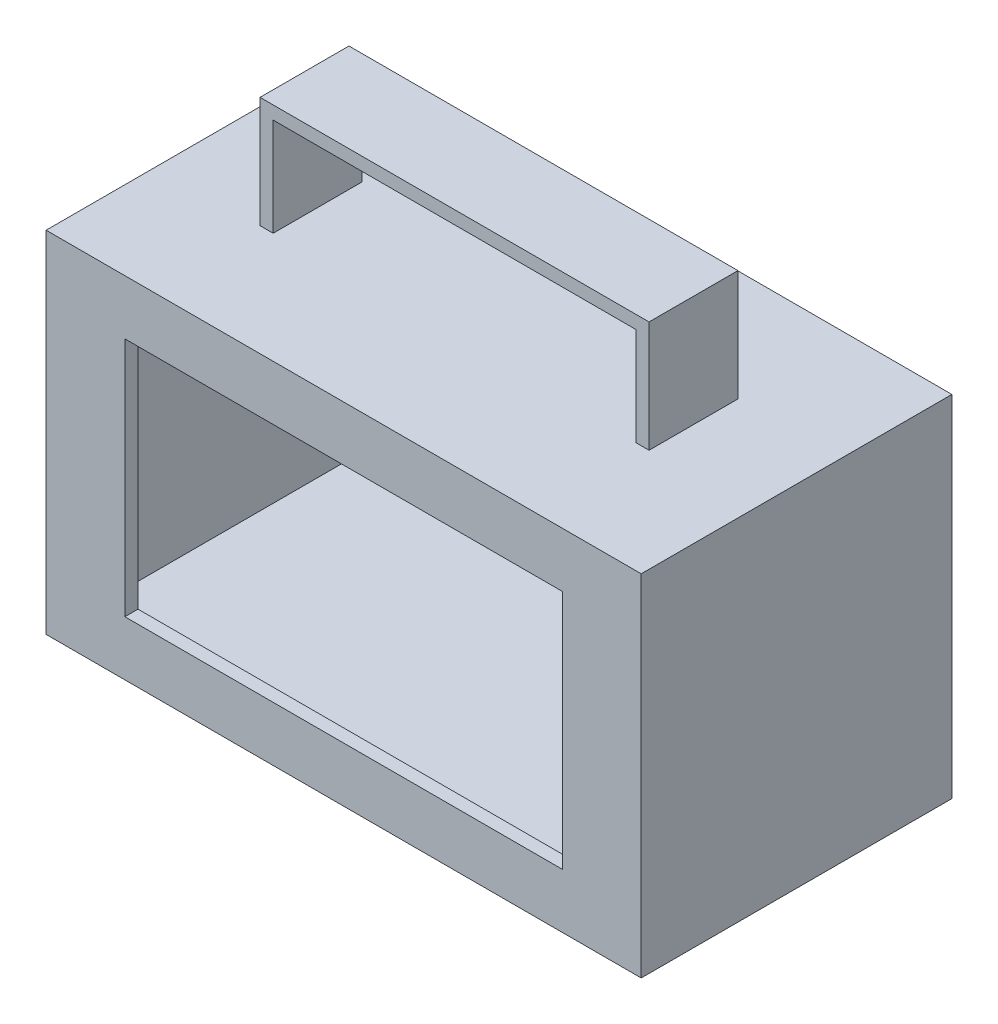
ISO-10303-21;
HEADER;
FILE_DESCRIPTION(('STEP AP214'),'2;1');
FILE_NAME('part.step','',(''),(''),'','','');
FILE_SCHEMA(('AUTOMOTIVE_DESIGN { 1 0 10303 214 1 1 1 1 }'));
ENDSEC;
DATA;
#1=APPLICATION_CONTEXT('core data for automotive mechanical design processes');
#2=APPLICATION_PROTOCOL_DEFINITION('international standard','automotive_design',2000,#1);
#3=PRODUCT_CONTEXT('',#1,'mechanical');
#4=PRODUCT('Part','Part','',(#3));
#5=PRODUCT_RELATED_PRODUCT_CATEGORY('part','',(#4));
#6=PRODUCT_DEFINITION_FORMATION('','',#4);
#7=PRODUCT_DEFINITION_CONTEXT('part definition',#1,'design');
#8=PRODUCT_DEFINITION('design','',#6,#7);
#9=PRODUCT_DEFINITION_SHAPE('','',#8);
#10=(LENGTH_UNIT() NAMED_UNIT(*) SI_UNIT(.MILLI.,.METRE.));
#11=(NAMED_UNIT(*) PLANE_ANGLE_UNIT() SI_UNIT($,.RADIAN.));
#12=(NAMED_UNIT(*) SI_UNIT($,.STERADIAN.) SOLID_ANGLE_UNIT());
#13=UNCERTAINTY_MEASURE_WITH_UNIT(LENGTH_MEASURE(1.E-05),#10,'distance_accuracy_value','');
#14=(GEOMETRIC_REPRESENTATION_CONTEXT(3) GLOBAL_UNCERTAINTY_ASSIGNED_CONTEXT((#13)) GLOBAL_UNIT_ASSIGNED_CONTEXT((#10,
#11,#12)) REPRESENTATION_CONTEXT('',''));
#15=CARTESIAN_POINT('',(0.,0.,0.));
#16=DIRECTION('',(0.,0.,1.));
#17=DIRECTION('',(1.,0.,0.));
#18=AXIS2_PLACEMENT_3D('',#15,#16,#17);
#19=CARTESIAN_POINT('',(-65.,207.034610777285,32.5));
#20=DIRECTION('',(0.,0.,1.));
#21=DIRECTION('',(1.,0.,0.));
#22=AXIS2_PLACEMENT_3D('',#19,#20,#21);
#23=PLANE('',#22);
#24=DIRECTION('',(1.,0.,0.));
#25=VECTOR('',#24,1.);
#26=CARTESIAN_POINT('',(-65.,12.5,32.5));
#27=LINE('',#26,#25);
#28=CARTESIAN_POINT('',(-50.,12.5,32.5));
#29=VERTEX_POINT('',#28);
#30=CARTESIAN_POINT('',(50.,12.5,32.5));
#31=VERTEX_POINT('',#30);
#32=EDGE_CURVE('E44',#29,#31,#27,.T.);
#33=ORIENTED_EDGE('',*,*,#32,.T.);
#34=DIRECTION('',(0.,1.,0.));
#35=VECTOR('',#34,1.);
#36=CARTESIAN_POINT('',(50.,207.034610777285,32.5));
#37=LINE('',#36,#35);
#38=CARTESIAN_POINT('',(50.,67.5,32.5));
#39=VERTEX_POINT('',#38);
#40=EDGE_CURVE('E11',#31,#39,#37,.T.);
#41=ORIENTED_EDGE('',*,*,#40,.T.);
#42=DIRECTION('',(-1.,0.,0.));
#43=VECTOR('',#42,1.);
#44=CARTESIAN_POINT('',(-65.,67.5,32.5));
#45=LINE('',#44,#43);
#46=CARTESIAN_POINT('',(-50.,67.5,32.5));
#47=VERTEX_POINT('',#46);
#48=EDGE_CURVE('E372',#39,#47,#45,.T.);
#49=ORIENTED_EDGE('',*,*,#48,.T.);
#50=DIRECTION('',(0.,-1.,0.));
#51=VECTOR('',#50,1.);
#52=CARTESIAN_POINT('',(-50.,207.034610777285,32.5));
#53=LINE('',#52,#51);
#54=EDGE_CURVE('E375',#47,#29,#53,.T.);
#55=ORIENTED_EDGE('',*,*,#54,.T.);
#56=EDGE_LOOP('',(#33,#41,#49,#55));
#57=FACE_BOUND('',#56,.T.);
#58=DIRECTION('',(0.,-1.,0.));
#59=VECTOR('',#58,1.);
#60=CARTESIAN_POINT('',(-65.,207.034610777285,32.5));
#61=LINE('',#60,#59);
#62=CARTESIAN_POINT('',(-65.,77.,32.5));
#63=VERTEX_POINT('',#62);
#64=CARTESIAN_POINT('',(-65.,3.,32.5));
#65=VERTEX_POINT('',#64);
#66=EDGE_CURVE('E312',#63,#65,#61,.T.);
#67=ORIENTED_EDGE('',*,*,#66,.F.);
#68=DIRECTION('',(1.,0.,0.));
#69=VECTOR('',#68,1.);
#70=CARTESIAN_POINT('',(-65.,77.,32.5));
#71=LINE('',#70,#69);
#72=CARTESIAN_POINT('',(65.,77.,32.5));
#73=VERTEX_POINT('',#72);
#74=EDGE_CURVE('E318',#63,#73,#71,.T.);
#75=ORIENTED_EDGE('',*,*,#74,.T.);
#76=DIRECTION('',(0.,-1.,0.));
#77=VECTOR('',#76,1.);
#78=CARTESIAN_POINT('',(65.,207.034610777285,32.5));
#79=LINE('',#78,#77);
#80=CARTESIAN_POINT('',(65.,3.,32.5));
#81=VERTEX_POINT('',#80);
#82=EDGE_CURVE('E315',#73,#81,#79,.T.);
#83=ORIENTED_EDGE('',*,*,#82,.T.);
#84=DIRECTION('',(-1.,0.,0.));
#85=VECTOR('',#84,1.);
#86=CARTESIAN_POINT('',(-65.,3.,32.5));
#87=LINE('',#86,#85);
#88=EDGE_CURVE('E309',#81,#65,#87,.T.);
#89=ORIENTED_EDGE('',*,*,#88,.T.);
#90=EDGE_LOOP('',(#67,#75,#83,#89));
#91=FACE_BOUND('',#90,.T.);
#92=ADVANCED_FACE('F36',(#57,#91),#23,.F.);
#93=CARTESIAN_POINT('',(-68.,80.,-32.5));
#94=DIRECTION('',(0.,0.,1.));
#95=DIRECTION('',(1.,0.,0.));
#96=AXIS2_PLACEMENT_3D('',#93,#94,#95);
#97=PLANE('',#96);
#98=DIRECTION('',(0.,1.,0.));
#99=VECTOR('',#98,1.);
#100=CARTESIAN_POINT('',(56.3249908040904,80.,-32.5));
#101=LINE('',#100,#99);
#102=CARTESIAN_POINT('',(56.3249908040903,21.2299770061563,-32.5));
#103=VERTEX_POINT('',#102);
#104=CARTESIAN_POINT('',(56.3249908040903,61.2299770061563,-32.5));
#105=VERTEX_POINT('',#104);
#106=EDGE_CURVE('E229',#103,#105,#101,.T.);
#107=ORIENTED_EDGE('',*,*,#106,.F.);
#108=DIRECTION('',(1.,0.,0.));
#109=VECTOR('',#108,1.);
#110=CARTESIAN_POINT('',(-68.,21.2299770061563,-32.5));
#111=LINE('',#110,#109);
#112=CARTESIAN_POINT('',(-53.6750091959097,21.2299770061563,-32.5));
#113=VERTEX_POINT('',#112);
#114=EDGE_CURVE('E222',#113,#103,#111,.T.);
#115=ORIENTED_EDGE('',*,*,#114,.F.);
#116=DIRECTION('',(0.,-1.,0.));
#117=VECTOR('',#116,1.);
#118=CARTESIAN_POINT('',(-53.6750091959096,80.,-32.5));
#119=LINE('',#118,#117);
#120=CARTESIAN_POINT('',(-53.6750091959097,61.2299770061563,-32.5));
#121=VERTEX_POINT('',#120);
#122=EDGE_CURVE('E203',#121,#113,#119,.T.);
#123=ORIENTED_EDGE('',*,*,#122,.F.);
#124=DIRECTION('',(-1.,0.,0.));
#125=VECTOR('',#124,1.);
#126=CARTESIAN_POINT('',(-68.,61.2299770061563,-32.5));
#127=LINE('',#126,#125);
#128=EDGE_CURVE('E227',#105,#121,#127,.T.);
#129=ORIENTED_EDGE('',*,*,#128,.F.);
#130=EDGE_LOOP('',(#107,#115,#123,#129));
#131=FACE_BOUND('',#130,.T.);
#132=DIRECTION('',(-1.,0.,0.));
#133=VECTOR('',#132,1.);
#134=CARTESIAN_POINT('',(0.,3.,-32.5));
#135=LINE('',#134,#133);
#136=CARTESIAN_POINT('',(65.,3.,-32.5));
#137=VERTEX_POINT('',#136);
#138=CARTESIAN_POINT('',(-65.,3.,-32.5));
#139=VERTEX_POINT('',#138);
#140=EDGE_CURVE('E321',#137,#139,#135,.T.);
#141=ORIENTED_EDGE('',*,*,#140,.F.);
#142=DIRECTION('',(0.,-1.,0.));
#143=VECTOR('',#142,1.);
#144=CARTESIAN_POINT('',(65.,80.,-32.5));
#145=LINE('',#144,#143);
#146=CARTESIAN_POINT('',(65.,77.,-32.5));
#147=VERTEX_POINT('',#146);
#148=EDGE_CURVE('E329',#147,#137,#145,.T.);
#149=ORIENTED_EDGE('',*,*,#148,.F.);
#150=DIRECTION('',(-1.,0.,0.));
#151=VECTOR('',#150,1.);
#152=CARTESIAN_POINT('',(0.,77.,-32.5));
#153=LINE('',#152,#151);
#154=CARTESIAN_POINT('',(-65.,77.,-32.5));
#155=VERTEX_POINT('',#154);
#156=EDGE_CURVE('E330',#147,#155,#153,.T.);
#157=ORIENTED_EDGE('',*,*,#156,.T.);
#158=DIRECTION('',(0.,-1.,0.));
#159=VECTOR('',#158,1.);
#160=CARTESIAN_POINT('',(-65.,80.,-32.5));
#161=LINE('',#160,#159);
#162=EDGE_CURVE('E325',#155,#139,#161,.T.);
#163=ORIENTED_EDGE('',*,*,#162,.T.);
#164=EDGE_LOOP('',(#141,#149,#157,#163));
#165=FACE_BOUND('',#164,.T.);
#166=ADVANCED_FACE('F411',(#131,#165),#97,.T.);
#167=CARTESIAN_POINT('',(0.,77.,0.));
#168=DIRECTION('',(0.,-1.,0.));
#169=DIRECTION('',(0.,0.,-1.));
#170=AXIS2_PLACEMENT_3D('',#167,#168,#169);
#171=PLANE('',#170);
#172=DIRECTION('',(0.,0.,-1.));
#173=VECTOR('',#172,1.);
#174=CARTESIAN_POINT('',(65.,77.,0.));
#175=LINE('',#174,#173);
#176=EDGE_CURVE('E337',#73,#147,#175,.T.);
#177=ORIENTED_EDGE('',*,*,#176,.F.);
#178=ORIENTED_EDGE('',*,*,#74,.F.);
#179=DIRECTION('',(0.,0.,1.));
#180=VECTOR('',#179,1.);
#181=CARTESIAN_POINT('',(-65.,77.,0.));
#182=LINE('',#181,#180);
#183=EDGE_CURVE('E333',#155,#63,#182,.T.);
#184=ORIENTED_EDGE('',*,*,#183,.F.);
#185=ORIENTED_EDGE('',*,*,#156,.F.);
#186=EDGE_LOOP('',(#177,#178,#184,#185));
#187=FACE_BOUND('',#186,.T.);
#188=ADVANCED_FACE('F416',(#187),#171,.T.);
#189=CARTESIAN_POINT('',(0.,3.,0.));
#190=DIRECTION('',(0.,-1.,0.));
#191=DIRECTION('',(0.,0.,-1.));
#192=AXIS2_PLACEMENT_3D('',#189,#190,#191);
#193=PLANE('',#192);
#194=ORIENTED_EDGE('',*,*,#88,.F.);
#195=DIRECTION('',(0.,0.,-1.));
#196=VECTOR('',#195,1.);
#197=CARTESIAN_POINT('',(65.,3.,0.));
#198=LINE('',#197,#196);
#199=EDGE_CURVE('E334',#81,#137,#198,.T.);
#200=ORIENTED_EDGE('',*,*,#199,.T.);
#201=ORIENTED_EDGE('',*,*,#140,.T.);
#202=DIRECTION('',(0.,0.,1.));
#203=VECTOR('',#202,1.);
#204=CARTESIAN_POINT('',(-65.,3.,0.));
#205=LINE('',#204,#203);
#206=EDGE_CURVE('E324',#139,#65,#205,.T.);
#207=ORIENTED_EDGE('',*,*,#206,.T.);
#208=EDGE_LOOP('',(#194,#200,#201,#207));
#209=FACE_BOUND('',#208,.T.);
#210=ADVANCED_FACE('F430',(#209),#193,.F.);
#211=CARTESIAN_POINT('',(65.,80.,-35.5));
#212=DIRECTION('',(-1.,0.,0.));
#213=DIRECTION('',(0.,0.,1.));
#214=AXIS2_PLACEMENT_3D('',#211,#212,#213);
#215=PLANE('',#214);
#216=ORIENTED_EDGE('',*,*,#199,.F.);
#217=ORIENTED_EDGE('',*,*,#82,.F.);
#218=ORIENTED_EDGE('',*,*,#176,.T.);
#219=ORIENTED_EDGE('',*,*,#148,.T.);
#220=EDGE_LOOP('',(#216,#217,#218,#219));
#221=FACE_BOUND('',#220,.T.);
#222=ADVANCED_FACE('F426',(#221),#215,.T.);
#223=CARTESIAN_POINT('',(-65.,80.,-35.5));
#224=DIRECTION('',(1.,0.,0.));
#225=DIRECTION('',(0.,0.,-1.));
#226=AXIS2_PLACEMENT_3D('',#223,#224,#225);
#227=PLANE('',#226);
#228=ORIENTED_EDGE('',*,*,#183,.T.);
#229=ORIENTED_EDGE('',*,*,#66,.T.);
#230=ORIENTED_EDGE('',*,*,#206,.F.);
#231=ORIENTED_EDGE('',*,*,#162,.F.);
#232=EDGE_LOOP('',(#228,#229,#230,#231));
#233=FACE_BOUND('',#232,.T.);
#234=ADVANCED_FACE('F423',(#233),#227,.T.);
#235=CARTESIAN_POINT('',(50.,67.5,25.5));
#236=DIRECTION('',(1.,0.,0.));
#237=DIRECTION('',(0.,1.,0.));
#238=AXIS2_PLACEMENT_3D('',#235,#236,#237);
#239=PLANE('',#238);
#240=DIRECTION('',(0.,0.,1.));
#241=VECTOR('',#240,1.);
#242=CARTESIAN_POINT('',(50.,12.5,25.5));
#243=LINE('',#242,#241);
#244=CARTESIAN_POINT('',(50.,12.5,35.5));
#245=VERTEX_POINT('',#244);
#246=EDGE_CURVE('E243',#31,#245,#243,.T.);
#247=ORIENTED_EDGE('',*,*,#246,.T.);
#248=DIRECTION('',(0.,1.,0.));
#249=VECTOR('',#248,1.);
#250=CARTESIAN_POINT('',(50.,67.5,35.5));
#251=LINE('',#250,#249);
#252=CARTESIAN_POINT('',(50.,67.5,35.5));
#253=VERTEX_POINT('',#252);
#254=EDGE_CURVE('E231',#245,#253,#251,.T.);
#255=ORIENTED_EDGE('',*,*,#254,.T.);
#256=DIRECTION('',(0.,0.,1.));
#257=VECTOR('',#256,1.);
#258=CARTESIAN_POINT('',(50.,67.5,25.5));
#259=LINE('',#258,#257);
#260=EDGE_CURVE('E242',#39,#253,#259,.T.);
#261=ORIENTED_EDGE('',*,*,#260,.F.);
#262=ORIENTED_EDGE('',*,*,#40,.F.);
#263=EDGE_LOOP('',(#247,#255,#261,#262));
#264=FACE_BOUND('',#263,.T.);
#265=ADVANCED_FACE('F396',(#264),#239,.F.);
#266=CARTESIAN_POINT('',(-50.,12.5,25.5));
#267=DIRECTION('',(0.,-1.,0.));
#268=DIRECTION('',(0.,0.,-1.));
#269=AXIS2_PLACEMENT_3D('',#266,#267,#268);
#270=PLANE('',#269);
#271=DIRECTION('',(0.,0.,1.));
#272=VECTOR('',#271,1.);
#273=CARTESIAN_POINT('',(-50.,12.5,25.5));
#274=LINE('',#273,#272);
#275=CARTESIAN_POINT('',(-50.,12.5,35.5));
#276=VERTEX_POINT('',#275);
#277=EDGE_CURVE('E246',#29,#276,#274,.T.);
#278=ORIENTED_EDGE('',*,*,#277,.T.);
#279=DIRECTION('',(1.,0.,0.));
#280=VECTOR('',#279,1.);
#281=CARTESIAN_POINT('',(-50.,12.5,35.5));
#282=LINE('',#281,#280);
#283=EDGE_CURVE('E239',#276,#245,#282,.T.);
#284=ORIENTED_EDGE('',*,*,#283,.T.);
#285=ORIENTED_EDGE('',*,*,#246,.F.);
#286=ORIENTED_EDGE('',*,*,#32,.F.);
#287=EDGE_LOOP('',(#278,#284,#285,#286));
#288=FACE_BOUND('',#287,.T.);
#289=ADVANCED_FACE('F384',(#288),#270,.F.);
#290=CARTESIAN_POINT('',(-50.,67.5,25.5));
#291=DIRECTION('',(-1.,0.,0.));
#292=DIRECTION('',(0.,-1.,0.));
#293=AXIS2_PLACEMENT_3D('',#290,#291,#292);
#294=PLANE('',#293);
#295=DIRECTION('',(0.,0.,1.));
#296=VECTOR('',#295,1.);
#297=CARTESIAN_POINT('',(-50.,67.5,25.5));
#298=LINE('',#297,#296);
#299=CARTESIAN_POINT('',(-50.,67.5,35.5));
#300=VERTEX_POINT('',#299);
#301=EDGE_CURVE('E248',#47,#300,#298,.T.);
#302=ORIENTED_EDGE('',*,*,#301,.T.);
#303=DIRECTION('',(0.,-1.,0.));
#304=VECTOR('',#303,1.);
#305=CARTESIAN_POINT('',(-50.,67.5,35.5));
#306=LINE('',#305,#304);
#307=EDGE_CURVE('E236',#300,#276,#306,.T.);
#308=ORIENTED_EDGE('',*,*,#307,.T.);
#309=ORIENTED_EDGE('',*,*,#277,.F.);
#310=ORIENTED_EDGE('',*,*,#54,.F.);
#311=EDGE_LOOP('',(#302,#308,#309,#310));
#312=FACE_BOUND('',#311,.T.);
#313=ADVANCED_FACE('F386',(#312),#294,.F.);
#314=CARTESIAN_POINT('',(-50.,67.5,25.5));
#315=DIRECTION('',(0.,1.,0.));
#316=DIRECTION('',(0.,0.,1.));
#317=AXIS2_PLACEMENT_3D('',#314,#315,#316);
#318=PLANE('',#317);
#319=ORIENTED_EDGE('',*,*,#260,.T.);
#320=DIRECTION('',(-1.,0.,0.));
#321=VECTOR('',#320,1.);
#322=CARTESIAN_POINT('',(-50.,67.5,35.5));
#323=LINE('',#322,#321);
#324=EDGE_CURVE('E233',#253,#300,#323,.T.);
#325=ORIENTED_EDGE('',*,*,#324,.T.);
#326=ORIENTED_EDGE('',*,*,#301,.F.);
#327=ORIENTED_EDGE('',*,*,#48,.F.);
#328=EDGE_LOOP('',(#319,#325,#326,#327));
#329=FACE_BOUND('',#328,.T.);
#330=ADVANCED_FACE('F398',(#329),#318,.F.);
#331=CARTESIAN_POINT('',(0.,80.,0.));
#332=DIRECTION('',(0.,-1.,0.));
#333=DIRECTION('',(0.,0.,-1.));
#334=AXIS2_PLACEMENT_3D('',#331,#332,#333);
#335=PLANE('',#334);
#336=DIRECTION('',(1.,0.,0.));
#337=VECTOR('',#336,1.);
#338=CARTESIAN_POINT('',(41.45,80.,10.16));
#339=LINE('',#338,#337);
#340=CARTESIAN_POINT('',(41.45,80.,10.16));
#341=VERTEX_POINT('',#340);
#342=CARTESIAN_POINT('',(44.45,80.,10.16));
#343=VERTEX_POINT('',#342);
#344=EDGE_CURVE('E262',#341,#343,#339,.T.);
#345=ORIENTED_EDGE('',*,*,#344,.F.);
#346=DIRECTION('',(0.,0.,-1.));
#347=VECTOR('',#346,1.);
#348=CARTESIAN_POINT('',(41.45,80.,10.16));
#349=LINE('',#348,#347);
#350=CARTESIAN_POINT('',(41.45,80.,-10.16));
#351=VERTEX_POINT('',#350);
#352=EDGE_CURVE('E298',#341,#351,#349,.T.);
#353=ORIENTED_EDGE('',*,*,#352,.T.);
#354=DIRECTION('',(1.,0.,0.));
#355=VECTOR('',#354,1.);
#356=CARTESIAN_POINT('',(41.45,80.,-10.16));
#357=LINE('',#356,#355);
#358=CARTESIAN_POINT('',(44.45,80.,-10.16));
#359=VERTEX_POINT('',#358);
#360=EDGE_CURVE('E279',#351,#359,#357,.T.);
#361=ORIENTED_EDGE('',*,*,#360,.T.);
#362=DIRECTION('',(0.,0.,-1.));
#363=VECTOR('',#362,1.);
#364=CARTESIAN_POINT('',(44.45,80.,10.16));
#365=LINE('',#364,#363);
#366=EDGE_CURVE('E295',#343,#359,#365,.T.);
#367=ORIENTED_EDGE('',*,*,#366,.F.);
#368=EDGE_LOOP('',(#345,#353,#361,#367));
#369=FACE_BOUND('',#368,.T.);
#370=DIRECTION('',(-1.,0.,0.));
#371=VECTOR('',#370,1.);
#372=CARTESIAN_POINT('',(-68.,80.,-35.5));
#373=LINE('',#372,#371);
#374=CARTESIAN_POINT('',(68.,80.,-35.5));
#375=VERTEX_POINT('',#374);
#376=CARTESIAN_POINT('',(-68.,80.,-35.5));
#377=VERTEX_POINT('',#376);
#378=EDGE_CURVE('E343',#375,#377,#373,.T.);
#379=ORIENTED_EDGE('',*,*,#378,.T.);
#380=DIRECTION('',(0.,0.,1.));
#381=VECTOR('',#380,1.);
#382=CARTESIAN_POINT('',(-68.,80.,-35.5));
#383=LINE('',#382,#381);
#384=CARTESIAN_POINT('',(-68.,80.,35.5));
#385=VERTEX_POINT('',#384);
#386=EDGE_CURVE('E346',#377,#385,#383,.T.);
#387=ORIENTED_EDGE('',*,*,#386,.T.);
#388=DIRECTION('',(1.,0.,0.));
#389=VECTOR('',#388,1.);
#390=CARTESIAN_POINT('',(-68.,80.,35.5));
#391=LINE('',#390,#389);
#392=CARTESIAN_POINT('',(68.,80.,35.5));
#393=VERTEX_POINT('',#392);
#394=EDGE_CURVE('E349',#385,#393,#391,.T.);
#395=ORIENTED_EDGE('',*,*,#394,.T.);
#396=DIRECTION('',(0.,0.,-1.));
#397=VECTOR('',#396,1.);
#398=CARTESIAN_POINT('',(68.,80.,-35.5));
#399=LINE('',#398,#397);
#400=EDGE_CURVE('E351',#393,#375,#399,.T.);
#401=ORIENTED_EDGE('',*,*,#400,.T.);
#402=EDGE_LOOP('',(#379,#387,#395,#401));
#403=FACE_BOUND('',#402,.T.);
#404=DIRECTION('',(1.,0.,0.));
#405=VECTOR('',#404,1.);
#406=CARTESIAN_POINT('',(-41.45,80.,10.16));
#407=LINE('',#406,#405);
#408=CARTESIAN_POINT('',(-44.45,80.,10.16));
#409=VERTEX_POINT('',#408);
#410=CARTESIAN_POINT('',(-41.45,80.,10.16));
#411=VERTEX_POINT('',#410);
#412=EDGE_CURVE('E252',#409,#411,#407,.T.);
#413=ORIENTED_EDGE('',*,*,#412,.F.);
#414=DIRECTION('',(0.,0.,-1.));
#415=VECTOR('',#414,1.);
#416=CARTESIAN_POINT('',(-44.45,80.,10.16));
#417=LINE('',#416,#415);
#418=CARTESIAN_POINT('',(-44.45,80.,-10.16));
#419=VERTEX_POINT('',#418);
#420=EDGE_CURVE('E270',#409,#419,#417,.T.);
#421=ORIENTED_EDGE('',*,*,#420,.T.);
#422=DIRECTION('',(1.,0.,0.));
#423=VECTOR('',#422,1.);
#424=CARTESIAN_POINT('',(-41.45,80.,-10.16));
#425=LINE('',#424,#423);
#426=CARTESIAN_POINT('',(-41.45,80.,-10.16));
#427=VERTEX_POINT('',#426);
#428=EDGE_CURVE('E245',#419,#427,#425,.T.);
#429=ORIENTED_EDGE('',*,*,#428,.T.);
#430=DIRECTION('',(0.,0.,-1.));
#431=VECTOR('',#430,1.);
#432=CARTESIAN_POINT('',(-41.45,80.,10.16));
#433=LINE('',#432,#431);
#434=EDGE_CURVE('E307',#411,#427,#433,.T.);
#435=ORIENTED_EDGE('',*,*,#434,.F.);
#436=EDGE_LOOP('',(#413,#421,#429,#435));
#437=FACE_BOUND('',#436,.T.);
#438=ADVANCED_FACE('F400',(#369,#403,#437),#335,.F.);
#439=CARTESIAN_POINT('',(-68.,80.,35.5));
#440=DIRECTION('',(0.,0.,-1.));
#441=DIRECTION('',(-1.,0.,0.));
#442=AXIS2_PLACEMENT_3D('',#439,#440,#441);
#443=PLANE('',#442);
#444=ORIENTED_EDGE('',*,*,#324,.F.);
#445=ORIENTED_EDGE('',*,*,#254,.F.);
#446=ORIENTED_EDGE('',*,*,#283,.F.);
#447=ORIENTED_EDGE('',*,*,#307,.F.);
#448=EDGE_LOOP('',(#444,#445,#446,#447));
#449=FACE_BOUND('',#448,.T.);
#450=DIRECTION('',(1.,0.,0.));
#451=VECTOR('',#450,1.);
#452=CARTESIAN_POINT('',(-68.,0.,35.5));
#453=LINE('',#452,#451);
#454=CARTESIAN_POINT('',(-68.,0.,35.5));
#455=VERTEX_POINT('',#454);
#456=CARTESIAN_POINT('',(68.,0.,35.5));
#457=VERTEX_POINT('',#456);
#458=EDGE_CURVE('E358',#455,#457,#453,.T.);
#459=ORIENTED_EDGE('',*,*,#458,.T.);
#460=DIRECTION('',(0.,-1.,0.));
#461=VECTOR('',#460,1.);
#462=CARTESIAN_POINT('',(68.,80.,35.5));
#463=LINE('',#462,#461);
#464=EDGE_CURVE('E363',#393,#457,#463,.T.);
#465=ORIENTED_EDGE('',*,*,#464,.F.);
#466=ORIENTED_EDGE('',*,*,#394,.F.);
#467=DIRECTION('',(0.,-1.,0.));
#468=VECTOR('',#467,1.);
#469=CARTESIAN_POINT('',(-68.,80.,35.5));
#470=LINE('',#469,#468);
#471=EDGE_CURVE('E366',#385,#455,#470,.T.);
#472=ORIENTED_EDGE('',*,*,#471,.T.);
#473=EDGE_LOOP('',(#459,#465,#466,#472));
#474=FACE_BOUND('',#473,.T.);
#475=ADVANCED_FACE('F392',(#449,#474),#443,.F.);
#476=CARTESIAN_POINT('',(-68.,80.,-35.5));
#477=DIRECTION('',(0.,0.,1.));
#478=DIRECTION('',(1.,0.,0.));
#479=AXIS2_PLACEMENT_3D('',#476,#477,#478);
#480=PLANE('',#479);
#481=DIRECTION('',(-1.,0.,0.));
#482=VECTOR('',#481,1.);
#483=CARTESIAN_POINT('',(56.3249908040903,21.2299770061563,-35.5));
#484=LINE('',#483,#482);
#485=CARTESIAN_POINT('',(56.3249908040904,21.2299770061563,-35.5));
#486=VERTEX_POINT('',#485);
#487=CARTESIAN_POINT('',(-53.6750091959097,21.2299770061563,-35.5));
#488=VERTEX_POINT('',#487);
#489=EDGE_CURVE('E209',#486,#488,#484,.T.);
#490=ORIENTED_EDGE('',*,*,#489,.F.);
#491=DIRECTION('',(0.,-1.,0.));
#492=VECTOR('',#491,1.);
#493=CARTESIAN_POINT('',(56.3249908040903,21.2299770061563,-35.5));
#494=LINE('',#493,#492);
#495=CARTESIAN_POINT('',(56.3249908040903,61.2299770061563,-35.5));
#496=VERTEX_POINT('',#495);
#497=EDGE_CURVE('E59',#496,#486,#494,.T.);
#498=ORIENTED_EDGE('',*,*,#497,.F.);
#499=DIRECTION('',(1.,0.,0.));
#500=VECTOR('',#499,1.);
#501=CARTESIAN_POINT('',(56.3249908040903,61.2299770061563,-35.5));
#502=LINE('',#501,#500);
#503=CARTESIAN_POINT('',(-53.6750091959097,61.2299770061563,-35.5));
#504=VERTEX_POINT('',#503);
#505=EDGE_CURVE('E215',#504,#496,#502,.T.);
#506=ORIENTED_EDGE('',*,*,#505,.F.);
#507=DIRECTION('',(0.,1.,0.));
#508=VECTOR('',#507,1.);
#509=CARTESIAN_POINT('',(-53.6750091959097,21.2299770061563,-35.5));
#510=LINE('',#509,#508);
#511=EDGE_CURVE('E200',#488,#504,#510,.T.);
#512=ORIENTED_EDGE('',*,*,#511,.F.);
#513=EDGE_LOOP('',(#490,#498,#506,#512));
#514=FACE_BOUND('',#513,.T.);
#515=DIRECTION('',(-1.,0.,0.));
#516=VECTOR('',#515,1.);
#517=CARTESIAN_POINT('',(-68.,0.,-35.5));
#518=LINE('',#517,#516);
#519=CARTESIAN_POINT('',(68.,0.,-35.5));
#520=VERTEX_POINT('',#519);
#521=CARTESIAN_POINT('',(-68.,0.,-35.5));
#522=VERTEX_POINT('',#521);
#523=EDGE_CURVE('E328',#520,#522,#518,.T.);
#524=ORIENTED_EDGE('',*,*,#523,.T.);
#525=DIRECTION('',(0.,-1.,0.));
#526=VECTOR('',#525,1.);
#527=CARTESIAN_POINT('',(-68.,80.,-35.5));
#528=LINE('',#527,#526);
#529=EDGE_CURVE('E369',#377,#522,#528,.T.);
#530=ORIENTED_EDGE('',*,*,#529,.F.);
#531=ORIENTED_EDGE('',*,*,#378,.F.);
#532=DIRECTION('',(0.,-1.,0.));
#533=VECTOR('',#532,1.);
#534=CARTESIAN_POINT('',(68.,80.,-35.5));
#535=LINE('',#534,#533);
#536=EDGE_CURVE('E353',#375,#520,#535,.T.);
#537=ORIENTED_EDGE('',*,*,#536,.T.);
#538=EDGE_LOOP('',(#524,#530,#531,#537));
#539=FACE_BOUND('',#538,.T.);
#540=ADVANCED_FACE('F38',(#514,#539),#480,.F.);
#541=CARTESIAN_POINT('',(-68.,80.,-35.5));
#542=DIRECTION('',(1.,0.,0.));
#543=DIRECTION('',(0.,0.,-1.));
#544=AXIS2_PLACEMENT_3D('',#541,#542,#543);
#545=PLANE('',#544);
#546=DIRECTION('',(0.,0.,1.));
#547=VECTOR('',#546,1.);
#548=CARTESIAN_POINT('',(-68.,0.,-35.5));
#549=LINE('',#548,#547);
#550=EDGE_CURVE('E356',#522,#455,#549,.T.);
#551=ORIENTED_EDGE('',*,*,#550,.T.);
#552=ORIENTED_EDGE('',*,*,#471,.F.);
#553=ORIENTED_EDGE('',*,*,#386,.F.);
#554=ORIENTED_EDGE('',*,*,#529,.T.);
#555=EDGE_LOOP('',(#551,#552,#553,#554));
#556=FACE_BOUND('',#555,.T.);
#557=ADVANCED_FACE('F445',(#556),#545,.F.);
#558=CARTESIAN_POINT('',(68.,80.,-35.5));
#559=DIRECTION('',(-1.,0.,0.));
#560=DIRECTION('',(0.,0.,1.));
#561=AXIS2_PLACEMENT_3D('',#558,#559,#560);
#562=PLANE('',#561);
#563=DIRECTION('',(0.,0.,-1.));
#564=VECTOR('',#563,1.);
#565=CARTESIAN_POINT('',(68.,0.,-35.5));
#566=LINE('',#565,#564);
#567=EDGE_CURVE('E347',#457,#520,#566,.T.);
#568=ORIENTED_EDGE('',*,*,#567,.T.);
#569=ORIENTED_EDGE('',*,*,#536,.F.);
#570=ORIENTED_EDGE('',*,*,#400,.F.);
#571=ORIENTED_EDGE('',*,*,#464,.T.);
#572=EDGE_LOOP('',(#568,#569,#570,#571));
#573=FACE_BOUND('',#572,.T.);
#574=ADVANCED_FACE('F441',(#573),#562,.F.);
#575=CARTESIAN_POINT('',(0.,0.,0.));
#576=DIRECTION('',(0.,-1.,0.));
#577=DIRECTION('',(0.,0.,-1.));
#578=AXIS2_PLACEMENT_3D('',#575,#576,#577);
#579=PLANE('',#578);
#580=ORIENTED_EDGE('',*,*,#523,.F.);
#581=ORIENTED_EDGE('',*,*,#567,.F.);
#582=ORIENTED_EDGE('',*,*,#458,.F.);
#583=ORIENTED_EDGE('',*,*,#550,.F.);
#584=EDGE_LOOP('',(#580,#581,#582,#583));
#585=FACE_BOUND('',#584,.T.);
#586=ADVANCED_FACE('F438',(#585),#579,.T.);
#587=CARTESIAN_POINT('',(-41.45,80.,10.16));
#588=DIRECTION('',(-1.,0.,0.));
#589=DIRECTION('',(0.,0.,1.));
#590=AXIS2_PLACEMENT_3D('',#587,#588,#589);
#591=PLANE('',#590);
#592=DIRECTION('',(0.,1.,0.));
#593=VECTOR('',#592,1.);
#594=CARTESIAN_POINT('',(-41.45,80.,-10.16));
#595=LINE('',#594,#593);
#596=CARTESIAN_POINT('',(-41.45,102.4,-10.16));
#597=VERTEX_POINT('',#596);
#598=EDGE_CURVE('E273',#427,#597,#595,.T.);
#599=ORIENTED_EDGE('',*,*,#598,.T.);
#600=DIRECTION('',(0.,0.,-1.));
#601=VECTOR('',#600,1.);
#602=CARTESIAN_POINT('',(-41.45,102.4,10.16));
#603=LINE('',#602,#601);
#604=CARTESIAN_POINT('',(-41.45,102.4,10.16));
#605=VERTEX_POINT('',#604);
#606=EDGE_CURVE('E304',#605,#597,#603,.T.);
#607=ORIENTED_EDGE('',*,*,#606,.F.);
#608=DIRECTION('',(0.,1.,0.));
#609=VECTOR('',#608,1.);
#610=CARTESIAN_POINT('',(-41.45,80.,10.16));
#611=LINE('',#610,#609);
#612=EDGE_CURVE('E255',#411,#605,#611,.T.);
#613=ORIENTED_EDGE('',*,*,#612,.F.);
#614=ORIENTED_EDGE('',*,*,#434,.T.);
#615=EDGE_LOOP('',(#599,#607,#613,#614));
#616=FACE_BOUND('',#615,.T.);
#617=ADVANCED_FACE('F420',(#616),#591,.F.);
#618=CARTESIAN_POINT('',(-41.45,102.4,10.16));
#619=DIRECTION('',(0.,1.,0.));
#620=DIRECTION('',(0.,0.,1.));
#621=AXIS2_PLACEMENT_3D('',#618,#619,#620);
#622=PLANE('',#621);
#623=DIRECTION('',(1.,0.,0.));
#624=VECTOR('',#623,1.);
#625=CARTESIAN_POINT('',(-41.45,102.4,-10.16));
#626=LINE('',#625,#624);
#627=CARTESIAN_POINT('',(41.45,102.4,-10.16));
#628=VERTEX_POINT('',#627);
#629=EDGE_CURVE('E275',#597,#628,#626,.T.);
#630=ORIENTED_EDGE('',*,*,#629,.T.);
#631=DIRECTION('',(0.,0.,-1.));
#632=VECTOR('',#631,1.);
#633=CARTESIAN_POINT('',(41.45,102.4,10.16));
#634=LINE('',#633,#632);
#635=CARTESIAN_POINT('',(41.45,102.4,10.16));
#636=VERTEX_POINT('',#635);
#637=EDGE_CURVE('E301',#636,#628,#634,.T.);
#638=ORIENTED_EDGE('',*,*,#637,.F.);
#639=DIRECTION('',(1.,0.,0.));
#640=VECTOR('',#639,1.);
#641=CARTESIAN_POINT('',(-41.45,102.4,10.16));
#642=LINE('',#641,#640);
#643=EDGE_CURVE('E258',#605,#636,#642,.T.);
#644=ORIENTED_EDGE('',*,*,#643,.F.);
#645=ORIENTED_EDGE('',*,*,#606,.T.);
#646=EDGE_LOOP('',(#630,#638,#644,#645));
#647=FACE_BOUND('',#646,.T.);
#648=ADVANCED_FACE('F487',(#647),#622,.F.);
#649=CARTESIAN_POINT('',(41.45,80.,10.16));
#650=DIRECTION('',(1.,0.,0.));
#651=DIRECTION('',(0.,0.,-1.));
#652=AXIS2_PLACEMENT_3D('',#649,#650,#651);
#653=PLANE('',#652);
#654=DIRECTION('',(0.,-1.,0.));
#655=VECTOR('',#654,1.);
#656=CARTESIAN_POINT('',(41.45,80.,-10.16));
#657=LINE('',#656,#655);
#658=EDGE_CURVE('E277',#628,#351,#657,.T.);
#659=ORIENTED_EDGE('',*,*,#658,.T.);
#660=ORIENTED_EDGE('',*,*,#352,.F.);
#661=DIRECTION('',(0.,-1.,0.));
#662=VECTOR('',#661,1.);
#663=CARTESIAN_POINT('',(41.45,80.,10.16));
#664=LINE('',#663,#662);
#665=EDGE_CURVE('E260',#636,#341,#664,.T.);
#666=ORIENTED_EDGE('',*,*,#665,.F.);
#667=ORIENTED_EDGE('',*,*,#637,.T.);
#668=EDGE_LOOP('',(#659,#660,#666,#667));
#669=FACE_BOUND('',#668,.T.);
#670=ADVANCED_FACE('F494',(#669),#653,.F.);
#671=CARTESIAN_POINT('',(44.45,80.,10.16));
#672=DIRECTION('',(-1.,0.,0.));
#673=DIRECTION('',(0.,-1.,0.));
#674=AXIS2_PLACEMENT_3D('',#671,#672,#673);
#675=PLANE('',#674);
#676=DIRECTION('',(0.,1.,0.));
#677=VECTOR('',#676,1.);
#678=CARTESIAN_POINT('',(44.45,80.,-10.16));
#679=LINE('',#678,#677);
#680=CARTESIAN_POINT('',(44.45,105.4,-10.16));
#681=VERTEX_POINT('',#680);
#682=EDGE_CURVE('E282',#359,#681,#679,.T.);
#683=ORIENTED_EDGE('',*,*,#682,.T.);
#684=DIRECTION('',(0.,0.,-1.));
#685=VECTOR('',#684,1.);
#686=CARTESIAN_POINT('',(44.45,105.4,10.16));
#687=LINE('',#686,#685);
#688=CARTESIAN_POINT('',(44.45,105.4,10.16));
#689=VERTEX_POINT('',#688);
#690=EDGE_CURVE('E292',#689,#681,#687,.T.);
#691=ORIENTED_EDGE('',*,*,#690,.F.);
#692=DIRECTION('',(0.,1.,0.));
#693=VECTOR('',#692,1.);
#694=CARTESIAN_POINT('',(44.45,80.,10.16));
#695=LINE('',#694,#693);
#696=EDGE_CURVE('E264',#343,#689,#695,.T.);
#697=ORIENTED_EDGE('',*,*,#696,.F.);
#698=ORIENTED_EDGE('',*,*,#366,.T.);
#699=EDGE_LOOP('',(#683,#691,#697,#698));
#700=FACE_BOUND('',#699,.T.);
#701=ADVANCED_FACE('F498',(#700),#675,.F.);
#702=CARTESIAN_POINT('',(-44.45,105.4,10.16));
#703=DIRECTION('',(0.,-1.,0.));
#704=DIRECTION('',(0.,0.,-1.));
#705=AXIS2_PLACEMENT_3D('',#702,#703,#704);
#706=PLANE('',#705);
#707=DIRECTION('',(-1.,0.,0.));
#708=VECTOR('',#707,1.);
#709=CARTESIAN_POINT('',(-44.45,105.4,-10.16));
#710=LINE('',#709,#708);
#711=CARTESIAN_POINT('',(-44.45,105.4,-10.16));
#712=VERTEX_POINT('',#711);
#713=EDGE_CURVE('E284',#681,#712,#710,.T.);
#714=ORIENTED_EDGE('',*,*,#713,.T.);
#715=DIRECTION('',(0.,0.,-1.));
#716=VECTOR('',#715,1.);
#717=CARTESIAN_POINT('',(-44.45,105.4,10.16));
#718=LINE('',#717,#716);
#719=CARTESIAN_POINT('',(-44.45,105.4,10.16));
#720=VERTEX_POINT('',#719);
#721=EDGE_CURVE('E289',#720,#712,#718,.T.);
#722=ORIENTED_EDGE('',*,*,#721,.F.);
#723=DIRECTION('',(-1.,0.,0.));
#724=VECTOR('',#723,1.);
#725=CARTESIAN_POINT('',(-44.45,105.4,10.16));
#726=LINE('',#725,#724);
#727=EDGE_CURVE('E266',#689,#720,#726,.T.);
#728=ORIENTED_EDGE('',*,*,#727,.F.);
#729=ORIENTED_EDGE('',*,*,#690,.T.);
#730=EDGE_LOOP('',(#714,#722,#728,#729));
#731=FACE_BOUND('',#730,.T.);
#732=ADVANCED_FACE('F501',(#731),#706,.F.);
#733=CARTESIAN_POINT('',(-44.45,80.,10.16));
#734=DIRECTION('',(1.,0.,0.));
#735=DIRECTION('',(0.,0.,-1.));
#736=AXIS2_PLACEMENT_3D('',#733,#734,#735);
#737=PLANE('',#736);
#738=DIRECTION('',(0.,-1.,0.));
#739=VECTOR('',#738,1.);
#740=CARTESIAN_POINT('',(-44.45,80.,-10.16));
#741=LINE('',#740,#739);
#742=EDGE_CURVE('E256',#712,#419,#741,.T.);
#743=ORIENTED_EDGE('',*,*,#742,.T.);
#744=ORIENTED_EDGE('',*,*,#420,.F.);
#745=DIRECTION('',(0.,-1.,0.));
#746=VECTOR('',#745,1.);
#747=CARTESIAN_POINT('',(-44.45,80.,10.16));
#748=LINE('',#747,#746);
#749=EDGE_CURVE('E268',#720,#409,#748,.T.);
#750=ORIENTED_EDGE('',*,*,#749,.F.);
#751=ORIENTED_EDGE('',*,*,#721,.T.);
#752=EDGE_LOOP('',(#743,#744,#750,#751));
#753=FACE_BOUND('',#752,.T.);
#754=ADVANCED_FACE('F475',(#753),#737,.F.);
#755=CARTESIAN_POINT('',(0.,0.,10.16));
#756=DIRECTION('',(0.,0.,-1.));
#757=DIRECTION('',(-1.,0.,0.));
#758=AXIS2_PLACEMENT_3D('',#755,#756,#757);
#759=PLANE('',#758);
#760=ORIENTED_EDGE('',*,*,#412,.T.);
#761=ORIENTED_EDGE('',*,*,#612,.T.);
#762=ORIENTED_EDGE('',*,*,#643,.T.);
#763=ORIENTED_EDGE('',*,*,#665,.T.);
#764=ORIENTED_EDGE('',*,*,#344,.T.);
#765=ORIENTED_EDGE('',*,*,#696,.T.);
#766=ORIENTED_EDGE('',*,*,#727,.T.);
#767=ORIENTED_EDGE('',*,*,#749,.T.);
#768=EDGE_LOOP('',(#760,#761,#762,#763,#764,#765,#766,#767));
#769=FACE_BOUND('',#768,.T.);
#770=ADVANCED_FACE('F469',(#769),#759,.F.);
#771=CARTESIAN_POINT('',(0.,0.,-10.16));
#772=DIRECTION('',(0.,0.,-1.));
#773=DIRECTION('',(-1.,0.,0.));
#774=AXIS2_PLACEMENT_3D('',#771,#772,#773);
#775=PLANE('',#774);
#776=ORIENTED_EDGE('',*,*,#428,.F.);
#777=ORIENTED_EDGE('',*,*,#742,.F.);
#778=ORIENTED_EDGE('',*,*,#713,.F.);
#779=ORIENTED_EDGE('',*,*,#682,.F.);
#780=ORIENTED_EDGE('',*,*,#360,.F.);
#781=ORIENTED_EDGE('',*,*,#658,.F.);
#782=ORIENTED_EDGE('',*,*,#629,.F.);
#783=ORIENTED_EDGE('',*,*,#598,.F.);
#784=EDGE_LOOP('',(#776,#777,#778,#779,#780,#781,#782,#783));
#785=FACE_BOUND('',#784,.T.);
#786=ADVANCED_FACE('F481',(#785),#775,.T.);
#787=CARTESIAN_POINT('',(56.3249908040903,21.2299770061563,-25.5));
#788=DIRECTION('',(1.,0.,0.));
#789=DIRECTION('',(0.,0.,-1.));
#790=AXIS2_PLACEMENT_3D('',#787,#788,#789);
#791=PLANE('',#790);
#792=ORIENTED_EDGE('',*,*,#106,.T.);
#793=DIRECTION('',(0.,0.,-1.));
#794=VECTOR('',#793,1.);
#795=CARTESIAN_POINT('',(56.3249908040903,61.2299770061563,-25.5));
#796=LINE('',#795,#794);
#797=EDGE_CURVE('E220',#105,#496,#796,.T.);
#798=ORIENTED_EDGE('',*,*,#797,.T.);
#799=ORIENTED_EDGE('',*,*,#497,.T.);
#800=DIRECTION('',(0.,0.,-1.));
#801=VECTOR('',#800,1.);
#802=CARTESIAN_POINT('',(56.3249908040903,21.2299770061563,-25.5));
#803=LINE('',#802,#801);
#804=EDGE_CURVE('E206',#103,#486,#803,.T.);
#805=ORIENTED_EDGE('',*,*,#804,.F.);
#806=EDGE_LOOP('',(#792,#798,#799,#805));
#807=FACE_BOUND('',#806,.T.);
#808=ADVANCED_FACE('F548',(#807),#791,.F.);
#809=CARTESIAN_POINT('',(56.3249908040903,61.2299770061563,-25.5));
#810=DIRECTION('',(0.,1.,0.));
#811=DIRECTION('',(0.,0.,1.));
#812=AXIS2_PLACEMENT_3D('',#809,#810,#811);
#813=PLANE('',#812);
#814=ORIENTED_EDGE('',*,*,#128,.T.);
#815=DIRECTION('',(0.,0.,-1.));
#816=VECTOR('',#815,1.);
#817=CARTESIAN_POINT('',(-53.6750091959097,61.2299770061563,-25.5));
#818=LINE('',#817,#816);
#819=EDGE_CURVE('E205',#121,#504,#818,.T.);
#820=ORIENTED_EDGE('',*,*,#819,.T.);
#821=ORIENTED_EDGE('',*,*,#505,.T.);
#822=ORIENTED_EDGE('',*,*,#797,.F.);
#823=EDGE_LOOP('',(#814,#820,#821,#822));
#824=FACE_BOUND('',#823,.T.);
#825=ADVANCED_FACE('F553',(#824),#813,.F.);
#826=CARTESIAN_POINT('',(-53.6750091959097,21.2299770061563,-25.5));
#827=DIRECTION('',(-1.,0.,0.));
#828=DIRECTION('',(0.,-1.,0.));
#829=AXIS2_PLACEMENT_3D('',#826,#827,#828);
#830=PLANE('',#829);
#831=ORIENTED_EDGE('',*,*,#122,.T.);
#832=DIRECTION('',(0.,0.,-1.));
#833=VECTOR('',#832,1.);
#834=CARTESIAN_POINT('',(-53.6750091959097,21.2299770061563,-25.5));
#835=LINE('',#834,#833);
#836=EDGE_CURVE('E51',#113,#488,#835,.T.);
#837=ORIENTED_EDGE('',*,*,#836,.T.);
#838=ORIENTED_EDGE('',*,*,#511,.T.);
#839=ORIENTED_EDGE('',*,*,#819,.F.);
#840=EDGE_LOOP('',(#831,#837,#838,#839));
#841=FACE_BOUND('',#840,.T.);
#842=ADVANCED_FACE('F197',(#841),#830,.F.);
#843=CARTESIAN_POINT('',(56.3249908040903,21.2299770061563,-25.5));
#844=DIRECTION('',(0.,-1.,0.));
#845=DIRECTION('',(0.,0.,-1.));
#846=AXIS2_PLACEMENT_3D('',#843,#844,#845);
#847=PLANE('',#846);
#848=ORIENTED_EDGE('',*,*,#114,.T.);
#849=ORIENTED_EDGE('',*,*,#804,.T.);
#850=ORIENTED_EDGE('',*,*,#489,.T.);
#851=ORIENTED_EDGE('',*,*,#836,.F.);
#852=EDGE_LOOP('',(#848,#849,#850,#851));
#853=FACE_BOUND('',#852,.T.);
#854=ADVANCED_FACE('F210',(#853),#847,.F.);
#855=CLOSED_SHELL('',(#92,#166,#188,#210,#222,#234,#265,#289,#313,#330,#438,#475,#540,#557,#574,
#586,#617,#648,#670,#701,#732,#754,#770,#786,#808,#825,#842,#854));
#856=MANIFOLD_SOLID_BREP('B2',#855);
#857=ADVANCED_BREP_SHAPE_REPRESENTATION('',(#18,#856),#14);
#858=SHAPE_DEFINITION_REPRESENTATION(#9,#857);
ENDSEC;
END-ISO-10303-21;
